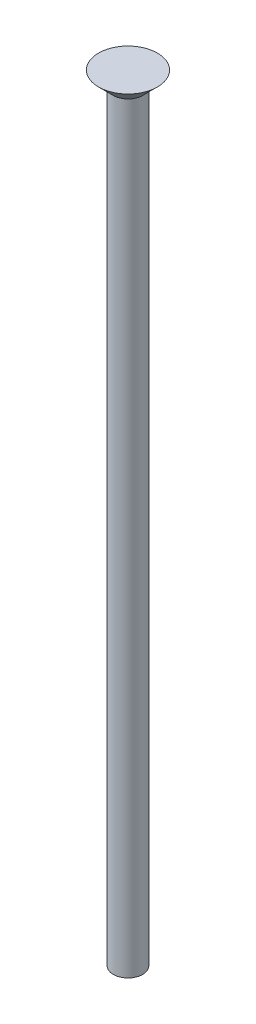
ISO-10303-21;
HEADER;
FILE_DESCRIPTION(('STEP AP214'),'2;1');
FILE_NAME('part.step','',(''),(''),'','','');
FILE_SCHEMA(('AUTOMOTIVE_DESIGN { 1 0 10303 214 1 1 1 1 }'));
ENDSEC;
DATA;
#1=APPLICATION_CONTEXT('core data for automotive mechanical design processes');
#2=APPLICATION_PROTOCOL_DEFINITION('international standard','automotive_design',2000,#1);
#3=PRODUCT_CONTEXT('',#1,'mechanical');
#4=PRODUCT('Part','Part','',(#3));
#5=PRODUCT_RELATED_PRODUCT_CATEGORY('part','',(#4));
#6=PRODUCT_DEFINITION_FORMATION('','',#4);
#7=PRODUCT_DEFINITION_CONTEXT('part definition',#1,'design');
#8=PRODUCT_DEFINITION('design','',#6,#7);
#9=PRODUCT_DEFINITION_SHAPE('','',#8);
#10=(LENGTH_UNIT() NAMED_UNIT(*) SI_UNIT(.MILLI.,.METRE.));
#11=(NAMED_UNIT(*) PLANE_ANGLE_UNIT() SI_UNIT($,.RADIAN.));
#12=(NAMED_UNIT(*) SI_UNIT($,.STERADIAN.) SOLID_ANGLE_UNIT());
#13=UNCERTAINTY_MEASURE_WITH_UNIT(LENGTH_MEASURE(1.E-05),#10,'distance_accuracy_value','');
#14=(GEOMETRIC_REPRESENTATION_CONTEXT(3) GLOBAL_UNCERTAINTY_ASSIGNED_CONTEXT((#13)) GLOBAL_UNIT_ASSIGNED_CONTEXT((#10,
#11,#12)) REPRESENTATION_CONTEXT('',''));
#15=CARTESIAN_POINT('',(0.,0.,0.));
#16=DIRECTION('',(0.,0.,1.));
#17=DIRECTION('',(1.,0.,0.));
#18=AXIS2_PLACEMENT_3D('',#15,#16,#17);
#19=CARTESIAN_POINT('',(0.,88.9254833995939,0.));
#20=DIRECTION('',(0.,-1.,0.));
#21=DIRECTION('',(0.,0.,-1.));
#22=AXIS2_PLACEMENT_3D('',#19,#20,#21);
#23=CYLINDRICAL_SURFACE('',#22,1.6);
#24=CARTESIAN_POINT('',(0.,0.,0.));
#25=DIRECTION('',(0.,1.,0.));
#26=DIRECTION('',(0.,0.,1.));
#27=AXIS2_PLACEMENT_3D('',#24,#25,#26);
#28=CIRCLE('',#27,1.6);
#29=CARTESIAN_POINT('',(0.,0.,1.6));
#30=VERTEX_POINT('',#29);
#31=EDGE_CURVE('E45',#30,#30,#28,.T.);
#32=ORIENTED_EDGE('',*,*,#31,.T.);
#33=EDGE_LOOP('',(#32));
#34=FACE_BOUND('',#33,.T.);
#35=CARTESIAN_POINT('',(0.,82.800015640017,0.));
#36=DIRECTION('',(0.,1.,0.));
#37=DIRECTION('',(0.,0.,1.));
#38=AXIS2_PLACEMENT_3D('',#35,#36,#37);
#39=CIRCLE('',#38,1.6);
#40=CARTESIAN_POINT('',(0.,82.800015640017,1.6));
#41=VERTEX_POINT('',#40);
#42=EDGE_CURVE('E10',#41,#41,#39,.T.);
#43=ORIENTED_EDGE('',*,*,#42,.F.);
#44=EDGE_LOOP('',(#43));
#45=FACE_BOUND('',#44,.T.);
#46=ADVANCED_FACE('F37',(#34,#45),#23,.T.);
#47=CARTESIAN_POINT('',(0.,0.,0.));
#48=DIRECTION('',(0.,1.,0.));
#49=DIRECTION('',(0.,0.,1.));
#50=AXIS2_PLACEMENT_3D('',#47,#48,#49);
#51=PLANE('',#50);
#52=ORIENTED_EDGE('',*,*,#31,.F.);
#53=EDGE_LOOP('',(#52));
#54=FACE_BOUND('',#53,.T.);
#55=ADVANCED_FACE('F61',(#54),#51,.F.);
#56=CARTESIAN_POINT('',(0.,82.800015640017,0.));
#57=DIRECTION('',(0.,1.,0.));
#58=DIRECTION('',(0.,0.,1.));
#59=AXIS2_PLACEMENT_3D('',#56,#57,#58);
#60=CONICAL_SURFACE('',#59,1.6,0.785391589673327);
#61=CARTESIAN_POINT('',(0.,84.4,0.));
#62=DIRECTION('',(0.,1.,0.));
#63=DIRECTION('',(0.,0.,1.));
#64=AXIS2_PLACEMENT_3D('',#61,#62,#63);
#65=CIRCLE('',#64,3.19996332440972);
#66=CARTESIAN_POINT('',(0.,84.4,3.19996332440972));
#67=VERTEX_POINT('',#66);
#68=EDGE_CURVE('E50',#67,#67,#65,.T.);
#69=ORIENTED_EDGE('',*,*,#68,.F.);
#70=EDGE_LOOP('',(#69));
#71=FACE_BOUND('',#70,.T.);
#72=ORIENTED_EDGE('',*,*,#42,.T.);
#73=EDGE_LOOP('',(#72));
#74=FACE_BOUND('',#73,.T.);
#75=ADVANCED_FACE('F59',(#71,#74),#60,.T.);
#76=CARTESIAN_POINT('',(31.9161380443078,84.4,-18.5761307148902));
#77=DIRECTION('',(0.,1.,0.));
#78=DIRECTION('',(0.843850961473454,0.,-0.536577631680941));
#79=AXIS2_PLACEMENT_3D('',#76,#77,#78);
#80=PLANE('',#79);
#81=ORIENTED_EDGE('',*,*,#68,.T.);
#82=EDGE_LOOP('',(#81));
#83=FACE_BOUND('',#82,.T.);
#84=ADVANCED_FACE('F39',(#83),#80,.T.);
#85=CLOSED_SHELL('',(#46,#55,#75,#84));
#86=MANIFOLD_SOLID_BREP('B2',#85);
#87=ADVANCED_BREP_SHAPE_REPRESENTATION('',(#18,#86),#14);
#88=SHAPE_DEFINITION_REPRESENTATION(#9,#87);
ENDSEC;
END-ISO-10303-21;
